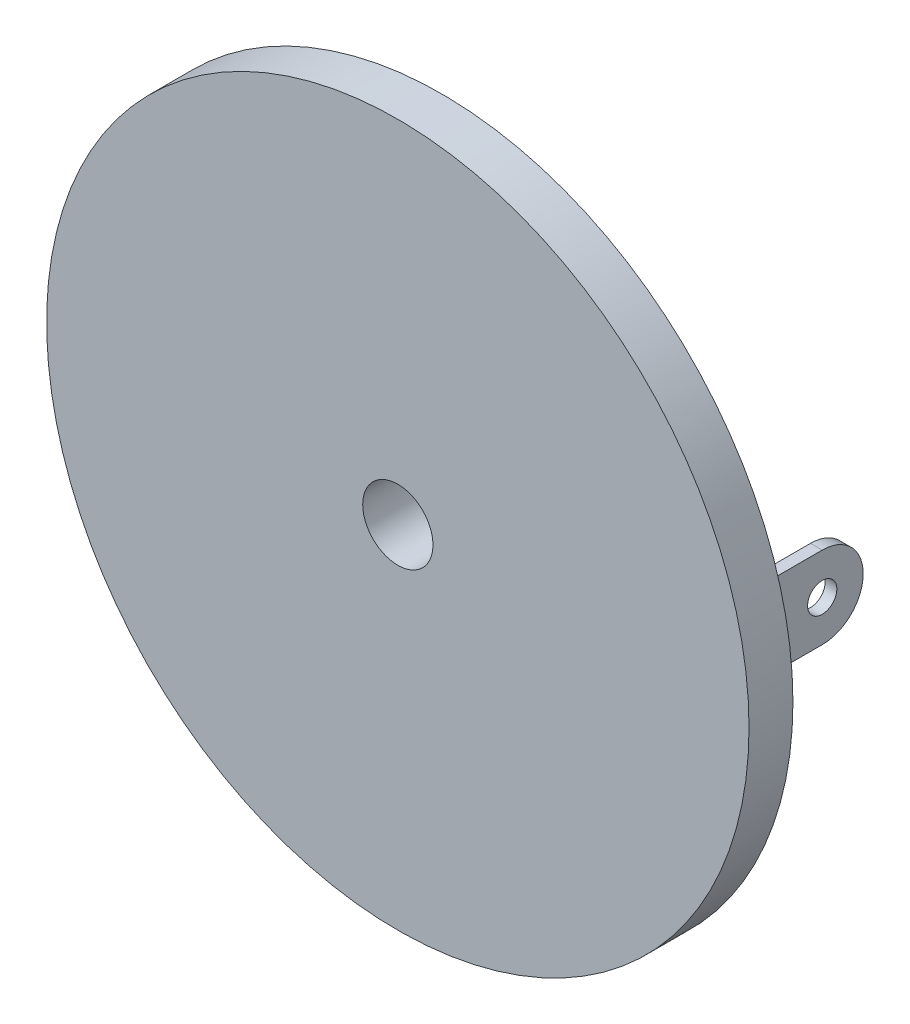
ISO-10303-21;
HEADER;
FILE_DESCRIPTION(('STEP AP214'),'2;1');
FILE_NAME('part.step','',(''),(''),'','','');
FILE_SCHEMA(('AUTOMOTIVE_DESIGN { 1 0 10303 214 1 1 1 1 }'));
ENDSEC;
DATA;
#1=APPLICATION_CONTEXT('core data for automotive mechanical design processes');
#2=APPLICATION_PROTOCOL_DEFINITION('international standard','automotive_design',2000,#1);
#3=PRODUCT_CONTEXT('',#1,'mechanical');
#4=PRODUCT('Part','Part','',(#3));
#5=PRODUCT_RELATED_PRODUCT_CATEGORY('part','',(#4));
#6=PRODUCT_DEFINITION_FORMATION('','',#4);
#7=PRODUCT_DEFINITION_CONTEXT('part definition',#1,'design');
#8=PRODUCT_DEFINITION('design','',#6,#7);
#9=PRODUCT_DEFINITION_SHAPE('','',#8);
#10=(LENGTH_UNIT() NAMED_UNIT(*) SI_UNIT(.MILLI.,.METRE.));
#11=(NAMED_UNIT(*) PLANE_ANGLE_UNIT() SI_UNIT($,.RADIAN.));
#12=(NAMED_UNIT(*) SI_UNIT($,.STERADIAN.) SOLID_ANGLE_UNIT());
#13=UNCERTAINTY_MEASURE_WITH_UNIT(LENGTH_MEASURE(1.E-05),#10,'distance_accuracy_value','');
#14=(GEOMETRIC_REPRESENTATION_CONTEXT(3) GLOBAL_UNCERTAINTY_ASSIGNED_CONTEXT((#13)) GLOBAL_UNIT_ASSIGNED_CONTEXT((#10,
#11,#12)) REPRESENTATION_CONTEXT('',''));
#15=CARTESIAN_POINT('',(0.,0.,0.));
#16=DIRECTION('',(0.,0.,1.));
#17=DIRECTION('',(1.,0.,0.));
#18=AXIS2_PLACEMENT_3D('',#15,#16,#17);
#19=CARTESIAN_POINT('',(0.,0.,0.));
#20=DIRECTION('',(0.,0.,1.));
#21=DIRECTION('',(1.,0.,0.));
#22=AXIS2_PLACEMENT_3D('',#19,#20,#21);
#23=PLANE('',#22);
#24=DIRECTION('',(0.,1.,0.));
#25=VECTOR('',#24,1.);
#26=CARTESIAN_POINT('',(-9.4,1.4,0.));
#27=LINE('',#26,#25);
#28=CARTESIAN_POINT('',(-9.4,-1.4,0.));
#29=VERTEX_POINT('',#28);
#30=CARTESIAN_POINT('',(-9.4,1.4,0.));
#31=VERTEX_POINT('',#30);
#32=EDGE_CURVE('E220',#29,#31,#27,.T.);
#33=ORIENTED_EDGE('',*,*,#32,.F.);
#34=DIRECTION('',(-1.,0.,0.));
#35=VECTOR('',#34,1.);
#36=CARTESIAN_POINT('',(-9.4,-1.4,0.));
#37=LINE('',#36,#35);
#38=CARTESIAN_POINT('',(-9.,-1.4,0.));
#39=VERTEX_POINT('',#38);
#40=EDGE_CURVE('E229',#39,#29,#37,.T.);
#41=ORIENTED_EDGE('',*,*,#40,.F.);
#42=DIRECTION('',(0.,-1.,0.));
#43=VECTOR('',#42,1.);
#44=CARTESIAN_POINT('',(-9.,1.4,0.));
#45=LINE('',#44,#43);
#46=CARTESIAN_POINT('',(-9.,1.4,0.));
#47=VERTEX_POINT('',#46);
#48=EDGE_CURVE('E226',#47,#39,#45,.T.);
#49=ORIENTED_EDGE('',*,*,#48,.F.);
#50=DIRECTION('',(1.,0.,0.));
#51=VECTOR('',#50,1.);
#52=CARTESIAN_POINT('',(-9.4,1.4,0.));
#53=LINE('',#52,#51);
#54=EDGE_CURVE('E223',#31,#47,#53,.T.);
#55=ORIENTED_EDGE('',*,*,#54,.F.);
#56=EDGE_LOOP('',(#33,#41,#49,#55));
#57=FACE_BOUND('',#56,.T.);
#58=CARTESIAN_POINT('',(0.,0.,0.));
#59=DIRECTION('',(0.,0.,1.));
#60=DIRECTION('',(1.,0.,0.));
#61=AXIS2_PLACEMENT_3D('',#58,#59,#60);
#62=CIRCLE('',#61,12.);
#63=CARTESIAN_POINT('',(12.,0.,0.));
#64=VERTEX_POINT('',#63);
#65=EDGE_CURVE('E121',#64,#64,#62,.T.);
#66=ORIENTED_EDGE('',*,*,#65,.F.);
#67=EDGE_LOOP('',(#66));
#68=FACE_BOUND('',#67,.T.);
#69=DIRECTION('',(0.,-1.,0.));
#70=VECTOR('',#69,1.);
#71=CARTESIAN_POINT('',(9.4,1.4,0.));
#72=LINE('',#71,#70);
#73=CARTESIAN_POINT('',(9.4,1.4,0.));
#74=VERTEX_POINT('',#73);
#75=CARTESIAN_POINT('',(9.4,-1.4,0.));
#76=VERTEX_POINT('',#75);
#77=EDGE_CURVE('E120',#74,#76,#72,.T.);
#78=ORIENTED_EDGE('',*,*,#77,.F.);
#79=DIRECTION('',(1.,0.,0.));
#80=VECTOR('',#79,1.);
#81=CARTESIAN_POINT('',(9.4,1.4,0.));
#82=LINE('',#81,#80);
#83=CARTESIAN_POINT('',(9.,1.4,0.));
#84=VERTEX_POINT('',#83);
#85=EDGE_CURVE('E246',#84,#74,#82,.T.);
#86=ORIENTED_EDGE('',*,*,#85,.F.);
#87=DIRECTION('',(0.,1.,0.));
#88=VECTOR('',#87,1.);
#89=CARTESIAN_POINT('',(9.,1.4,0.));
#90=LINE('',#89,#88);
#91=CARTESIAN_POINT('',(9.,-1.4,0.));
#92=VERTEX_POINT('',#91);
#93=EDGE_CURVE('E243',#92,#84,#90,.T.);
#94=ORIENTED_EDGE('',*,*,#93,.F.);
#95=DIRECTION('',(-1.,0.,0.));
#96=VECTOR('',#95,1.);
#97=CARTESIAN_POINT('',(9.4,-1.4,0.));
#98=LINE('',#97,#96);
#99=EDGE_CURVE('E241',#76,#92,#98,.T.);
#100=ORIENTED_EDGE('',*,*,#99,.F.);
#101=EDGE_LOOP('',(#78,#86,#94,#100));
#102=FACE_BOUND('',#101,.T.);
#103=CARTESIAN_POINT('',(0.,0.,0.));
#104=DIRECTION('',(0.,0.,1.));
#105=DIRECTION('',(1.,0.,0.));
#106=AXIS2_PLACEMENT_3D('',#103,#104,#105);
#107=CIRCLE('',#106,4.2);
#108=CARTESIAN_POINT('',(4.2,0.,0.));
#109=VERTEX_POINT('',#108);
#110=EDGE_CURVE('E11',#109,#109,#107,.F.);
#111=ORIENTED_EDGE('',*,*,#110,.F.);
#112=EDGE_LOOP('',(#111));
#113=FACE_BOUND('',#112,.T.);
#114=ADVANCED_FACE('F34',(#57,#68,#102,#113),#23,.F.);
#115=CARTESIAN_POINT('',(0.,0.,1.5));
#116=DIRECTION('',(0.,0.,-1.));
#117=DIRECTION('',(-1.,0.,0.));
#118=AXIS2_PLACEMENT_3D('',#115,#116,#117);
#119=CYLINDRICAL_SURFACE('',#118,12.);
#120=CARTESIAN_POINT('',(0.,0.,1.5));
#121=DIRECTION('',(0.,0.,1.));
#122=DIRECTION('',(1.,0.,0.));
#123=AXIS2_PLACEMENT_3D('',#120,#121,#122);
#124=CIRCLE('',#123,12.);
#125=CARTESIAN_POINT('',(12.,0.,1.5));
#126=VERTEX_POINT('',#125);
#127=EDGE_CURVE('E43',#126,#126,#124,.T.);
#128=ORIENTED_EDGE('',*,*,#127,.F.);
#129=EDGE_LOOP('',(#128));
#130=FACE_BOUND('',#129,.T.);
#131=ORIENTED_EDGE('',*,*,#65,.T.);
#132=EDGE_LOOP('',(#131));
#133=FACE_BOUND('',#132,.T.);
#134=ADVANCED_FACE('F36',(#130,#133),#119,.T.);
#135=CARTESIAN_POINT('',(0.,0.,1.5));
#136=DIRECTION('',(0.,0.,1.));
#137=DIRECTION('',(1.,0.,0.));
#138=AXIS2_PLACEMENT_3D('',#135,#136,#137);
#139=PLANE('',#138);
#140=CARTESIAN_POINT('',(0.,0.,1.5));
#141=DIRECTION('',(0.,0.,-1.));
#142=DIRECTION('',(-1.,0.,0.));
#143=AXIS2_PLACEMENT_3D('',#140,#141,#142);
#144=CIRCLE('',#143,1.2);
#145=CARTESIAN_POINT('',(-1.2,0.,1.5));
#146=VERTEX_POINT('',#145);
#147=EDGE_CURVE('E106',#146,#146,#144,.T.);
#148=ORIENTED_EDGE('',*,*,#147,.T.);
#149=EDGE_LOOP('',(#148));
#150=FACE_BOUND('',#149,.T.);
#151=ORIENTED_EDGE('',*,*,#127,.T.);
#152=EDGE_LOOP('',(#151));
#153=FACE_BOUND('',#152,.T.);
#154=ADVANCED_FACE('F132',(#150,#153),#139,.T.);
#155=CARTESIAN_POINT('',(9.4,1.4,-5.));
#156=DIRECTION('',(-1.,0.,0.));
#157=DIRECTION('',(0.,0.,1.));
#158=AXIS2_PLACEMENT_3D('',#155,#156,#157);
#159=PLANE('',#158);
#160=CARTESIAN_POINT('',(9.4,0.,-3.6));
#161=DIRECTION('',(1.,0.,0.));
#162=DIRECTION('',(0.,0.,-1.));
#163=AXIS2_PLACEMENT_3D('',#160,#161,#162);
#164=CIRCLE('',#163,0.500000000000001);
#165=CARTESIAN_POINT('',(9.4,0.,-4.1));
#166=VERTEX_POINT('',#165);
#167=EDGE_CURVE('E208',#166,#166,#164,.T.);
#168=ORIENTED_EDGE('',*,*,#167,.F.);
#169=EDGE_LOOP('',(#168));
#170=FACE_BOUND('',#169,.T.);
#171=DIRECTION('',(0.,0.,1.));
#172=VECTOR('',#171,1.);
#173=CARTESIAN_POINT('',(9.4,-1.4,-5.));
#174=LINE('',#173,#172);
#175=CARTESIAN_POINT('',(9.4,-1.4,-3.6));
#176=VERTEX_POINT('',#175);
#177=EDGE_CURVE('E112',#176,#76,#174,.T.);
#178=ORIENTED_EDGE('',*,*,#177,.F.);
#179=CARTESIAN_POINT('',(9.4,0.,-3.6));
#180=DIRECTION('',(-1.,0.,0.));
#181=DIRECTION('',(0.,0.,-1.));
#182=AXIS2_PLACEMENT_3D('',#179,#180,#181);
#183=CIRCLE('',#182,1.4);
#184=CARTESIAN_POINT('',(9.4,1.4,-3.6));
#185=VERTEX_POINT('',#184);
#186=EDGE_CURVE('E98',#185,#176,#183,.T.);
#187=ORIENTED_EDGE('',*,*,#186,.F.);
#188=DIRECTION('',(0.,0.,1.));
#189=VECTOR('',#188,1.);
#190=CARTESIAN_POINT('',(9.4,1.4,-5.));
#191=LINE('',#190,#189);
#192=EDGE_CURVE('E248',#185,#74,#191,.T.);
#193=ORIENTED_EDGE('',*,*,#192,.T.);
#194=ORIENTED_EDGE('',*,*,#77,.T.);
#195=EDGE_LOOP('',(#178,#187,#193,#194));
#196=FACE_BOUND('',#195,.T.);
#197=ADVANCED_FACE('F118',(#170,#196),#159,.F.);
#198=CARTESIAN_POINT('',(9.4,-1.4,-5.));
#199=DIRECTION('',(0.,1.,0.));
#200=DIRECTION('',(0.,0.,1.));
#201=AXIS2_PLACEMENT_3D('',#198,#199,#200);
#202=PLANE('',#201);
#203=DIRECTION('',(0.,0.,1.));
#204=VECTOR('',#203,1.);
#205=CARTESIAN_POINT('',(9.,-1.4,-5.));
#206=LINE('',#205,#204);
#207=CARTESIAN_POINT('',(9.,-1.4,-3.6));
#208=VERTEX_POINT('',#207);
#209=EDGE_CURVE('E114',#208,#92,#206,.T.);
#210=ORIENTED_EDGE('',*,*,#209,.F.);
#211=DIRECTION('',(1.,0.,0.));
#212=VECTOR('',#211,1.);
#213=CARTESIAN_POINT('',(-12.,-1.4,-3.6));
#214=LINE('',#213,#212);
#215=EDGE_CURVE('E101',#208,#176,#214,.T.);
#216=ORIENTED_EDGE('',*,*,#215,.T.);
#217=ORIENTED_EDGE('',*,*,#177,.T.);
#218=ORIENTED_EDGE('',*,*,#99,.T.);
#219=EDGE_LOOP('',(#210,#216,#217,#218));
#220=FACE_BOUND('',#219,.T.);
#221=ADVANCED_FACE('F110',(#220),#202,.F.);
#222=CARTESIAN_POINT('',(9.,1.4,-5.));
#223=DIRECTION('',(1.,0.,0.));
#224=DIRECTION('',(0.,0.,-1.));
#225=AXIS2_PLACEMENT_3D('',#222,#223,#224);
#226=PLANE('',#225);
#227=CARTESIAN_POINT('',(9.,0.,-3.6));
#228=DIRECTION('',(1.,0.,0.));
#229=DIRECTION('',(0.,0.,-1.));
#230=AXIS2_PLACEMENT_3D('',#227,#228,#229);
#231=CIRCLE('',#230,0.500000000000001);
#232=CARTESIAN_POINT('',(9.,0.,-4.1));
#233=VERTEX_POINT('',#232);
#234=EDGE_CURVE('E214',#233,#233,#231,.T.);
#235=ORIENTED_EDGE('',*,*,#234,.T.);
#236=EDGE_LOOP('',(#235));
#237=FACE_BOUND('',#236,.T.);
#238=DIRECTION('',(0.,0.,1.));
#239=VECTOR('',#238,1.);
#240=CARTESIAN_POINT('',(9.,1.4,-5.));
#241=LINE('',#240,#239);
#242=CARTESIAN_POINT('',(9.,1.4,-3.6));
#243=VERTEX_POINT('',#242);
#244=EDGE_CURVE('E125',#243,#84,#241,.T.);
#245=ORIENTED_EDGE('',*,*,#244,.F.);
#246=CARTESIAN_POINT('',(9.,0.,-3.6));
#247=DIRECTION('',(1.,0.,0.));
#248=DIRECTION('',(0.,0.,-1.));
#249=AXIS2_PLACEMENT_3D('',#246,#247,#248);
#250=CIRCLE('',#249,1.4);
#251=EDGE_CURVE('E50',#243,#208,#250,.F.);
#252=ORIENTED_EDGE('',*,*,#251,.T.);
#253=ORIENTED_EDGE('',*,*,#209,.T.);
#254=ORIENTED_EDGE('',*,*,#93,.T.);
#255=EDGE_LOOP('',(#245,#252,#253,#254));
#256=FACE_BOUND('',#255,.T.);
#257=ADVANCED_FACE('F180',(#237,#256),#226,.F.);
#258=CARTESIAN_POINT('',(9.4,1.4,-5.));
#259=DIRECTION('',(0.,-1.,0.));
#260=DIRECTION('',(0.,0.,-1.));
#261=AXIS2_PLACEMENT_3D('',#258,#259,#260);
#262=PLANE('',#261);
#263=ORIENTED_EDGE('',*,*,#192,.F.);
#264=DIRECTION('',(1.,0.,0.));
#265=VECTOR('',#264,1.);
#266=CARTESIAN_POINT('',(-12.,1.4,-3.6));
#267=LINE('',#266,#265);
#268=EDGE_CURVE('E102',#243,#185,#267,.T.);
#269=ORIENTED_EDGE('',*,*,#268,.F.);
#270=ORIENTED_EDGE('',*,*,#244,.T.);
#271=ORIENTED_EDGE('',*,*,#85,.T.);
#272=EDGE_LOOP('',(#263,#269,#270,#271));
#273=FACE_BOUND('',#272,.T.);
#274=ADVANCED_FACE('F176',(#273),#262,.F.);
#275=CARTESIAN_POINT('',(-9.4,1.4,-5.));
#276=DIRECTION('',(1.,0.,0.));
#277=DIRECTION('',(0.,0.,-1.));
#278=AXIS2_PLACEMENT_3D('',#275,#276,#277);
#279=PLANE('',#278);
#280=CARTESIAN_POINT('',(-9.4,0.,-3.6));
#281=DIRECTION('',(1.,0.,0.));
#282=DIRECTION('',(0.,0.,-1.));
#283=AXIS2_PLACEMENT_3D('',#280,#281,#282);
#284=CIRCLE('',#283,0.500000000000001);
#285=CARTESIAN_POINT('',(-9.4,0.,-4.1));
#286=VERTEX_POINT('',#285);
#287=EDGE_CURVE('E211',#286,#286,#284,.T.);
#288=ORIENTED_EDGE('',*,*,#287,.T.);
#289=EDGE_LOOP('',(#288));
#290=FACE_BOUND('',#289,.T.);
#291=DIRECTION('',(0.,0.,1.));
#292=VECTOR('',#291,1.);
#293=CARTESIAN_POINT('',(-9.4,1.4,-5.));
#294=LINE('',#293,#292);
#295=CARTESIAN_POINT('',(-9.4,1.4,-3.6));
#296=VERTEX_POINT('',#295);
#297=EDGE_CURVE('E238',#296,#31,#294,.T.);
#298=ORIENTED_EDGE('',*,*,#297,.F.);
#299=CARTESIAN_POINT('',(-9.4,0.,-3.6));
#300=DIRECTION('',(1.,0.,0.));
#301=DIRECTION('',(0.,0.,-1.));
#302=AXIS2_PLACEMENT_3D('',#299,#300,#301);
#303=CIRCLE('',#302,1.4);
#304=CARTESIAN_POINT('',(-9.4,-1.4,-3.6));
#305=VERTEX_POINT('',#304);
#306=EDGE_CURVE('E204',#296,#305,#303,.F.);
#307=ORIENTED_EDGE('',*,*,#306,.T.);
#308=DIRECTION('',(0.,0.,1.));
#309=VECTOR('',#308,1.);
#310=CARTESIAN_POINT('',(-9.4,-1.4,-5.));
#311=LINE('',#310,#309);
#312=EDGE_CURVE('E232',#305,#29,#311,.T.);
#313=ORIENTED_EDGE('',*,*,#312,.T.);
#314=ORIENTED_EDGE('',*,*,#32,.T.);
#315=EDGE_LOOP('',(#298,#307,#313,#314));
#316=FACE_BOUND('',#315,.T.);
#317=ADVANCED_FACE('F172',(#290,#316),#279,.F.);
#318=CARTESIAN_POINT('',(-9.4,1.4,-5.));
#319=DIRECTION('',(0.,-1.,0.));
#320=DIRECTION('',(0.,0.,-1.));
#321=AXIS2_PLACEMENT_3D('',#318,#319,#320);
#322=PLANE('',#321);
#323=DIRECTION('',(0.,0.,1.));
#324=VECTOR('',#323,1.);
#325=CARTESIAN_POINT('',(-9.,1.4,-5.));
#326=LINE('',#325,#324);
#327=CARTESIAN_POINT('',(-9.,1.4,-3.6));
#328=VERTEX_POINT('',#327);
#329=EDGE_CURVE('E236',#328,#47,#326,.T.);
#330=ORIENTED_EDGE('',*,*,#329,.F.);
#331=EDGE_CURVE('E201',#296,#328,#267,.T.);
#332=ORIENTED_EDGE('',*,*,#331,.F.);
#333=ORIENTED_EDGE('',*,*,#297,.T.);
#334=ORIENTED_EDGE('',*,*,#54,.T.);
#335=EDGE_LOOP('',(#330,#332,#333,#334));
#336=FACE_BOUND('',#335,.T.);
#337=ADVANCED_FACE('F168',(#336),#322,.F.);
#338=CARTESIAN_POINT('',(-9.,1.4,-5.));
#339=DIRECTION('',(-1.,0.,0.));
#340=DIRECTION('',(0.,0.,1.));
#341=AXIS2_PLACEMENT_3D('',#338,#339,#340);
#342=PLANE('',#341);
#343=CARTESIAN_POINT('',(-9.,0.,-3.6));
#344=DIRECTION('',(-1.,0.,0.));
#345=DIRECTION('',(0.,0.,1.));
#346=AXIS2_PLACEMENT_3D('',#343,#344,#345);
#347=CIRCLE('',#346,0.500000000000001);
#348=CARTESIAN_POINT('',(-9.,0.,-3.1));
#349=VERTEX_POINT('',#348);
#350=EDGE_CURVE('E38',#349,#349,#347,.T.);
#351=ORIENTED_EDGE('',*,*,#350,.T.);
#352=EDGE_LOOP('',(#351));
#353=FACE_BOUND('',#352,.T.);
#354=DIRECTION('',(0.,0.,1.));
#355=VECTOR('',#354,1.);
#356=CARTESIAN_POINT('',(-9.,-1.4,-5.));
#357=LINE('',#356,#355);
#358=CARTESIAN_POINT('',(-9.,-1.4,-3.6));
#359=VERTEX_POINT('',#358);
#360=EDGE_CURVE('E234',#359,#39,#357,.T.);
#361=ORIENTED_EDGE('',*,*,#360,.F.);
#362=CARTESIAN_POINT('',(-9.,0.,-3.6));
#363=DIRECTION('',(-1.,0.,0.));
#364=DIRECTION('',(0.,0.,1.));
#365=AXIS2_PLACEMENT_3D('',#362,#363,#364);
#366=CIRCLE('',#365,1.4);
#367=EDGE_CURVE('E58',#359,#328,#366,.F.);
#368=ORIENTED_EDGE('',*,*,#367,.T.);
#369=ORIENTED_EDGE('',*,*,#329,.T.);
#370=ORIENTED_EDGE('',*,*,#48,.T.);
#371=EDGE_LOOP('',(#361,#368,#369,#370));
#372=FACE_BOUND('',#371,.T.);
#373=ADVANCED_FACE('F160',(#353,#372),#342,.F.);
#374=CARTESIAN_POINT('',(-9.4,-1.4,-5.));
#375=DIRECTION('',(0.,1.,0.));
#376=DIRECTION('',(0.,0.,1.));
#377=AXIS2_PLACEMENT_3D('',#374,#375,#376);
#378=PLANE('',#377);
#379=ORIENTED_EDGE('',*,*,#312,.F.);
#380=EDGE_CURVE('E115',#305,#359,#214,.T.);
#381=ORIENTED_EDGE('',*,*,#380,.T.);
#382=ORIENTED_EDGE('',*,*,#360,.T.);
#383=ORIENTED_EDGE('',*,*,#40,.T.);
#384=EDGE_LOOP('',(#379,#381,#382,#383));
#385=FACE_BOUND('',#384,.T.);
#386=ADVANCED_FACE('F150',(#385),#378,.F.);
#387=CARTESIAN_POINT('',(0.,0.,-2.));
#388=DIRECTION('',(0.,0.,1.));
#389=DIRECTION('',(1.,0.,0.));
#390=AXIS2_PLACEMENT_3D('',#387,#388,#389);
#391=CYLINDRICAL_SURFACE('',#390,4.2);
#392=CARTESIAN_POINT('',(0.,0.,-2.));
#393=DIRECTION('',(0.,0.,-1.));
#394=DIRECTION('',(-1.,0.,0.));
#395=AXIS2_PLACEMENT_3D('',#392,#393,#394);
#396=CIRCLE('',#395,4.2);
#397=CARTESIAN_POINT('',(-4.2,0.,-2.));
#398=VERTEX_POINT('',#397);
#399=EDGE_CURVE('E217',#398,#398,#396,.T.);
#400=ORIENTED_EDGE('',*,*,#399,.F.);
#401=EDGE_LOOP('',(#400));
#402=FACE_BOUND('',#401,.T.);
#403=ORIENTED_EDGE('',*,*,#110,.T.);
#404=EDGE_LOOP('',(#403));
#405=FACE_BOUND('',#404,.T.);
#406=ADVANCED_FACE('F147',(#402,#405),#391,.T.);
#407=CARTESIAN_POINT('',(0.,0.,-2.));
#408=DIRECTION('',(0.,0.,-1.));
#409=DIRECTION('',(-1.,0.,0.));
#410=AXIS2_PLACEMENT_3D('',#407,#408,#409);
#411=PLANE('',#410);
#412=CARTESIAN_POINT('',(0.,0.,-2.));
#413=DIRECTION('',(0.,0.,-1.));
#414=DIRECTION('',(-1.,0.,0.));
#415=AXIS2_PLACEMENT_3D('',#412,#413,#414);
#416=CIRCLE('',#415,1.2);
#417=CARTESIAN_POINT('',(-1.2,0.,-2.));
#418=VERTEX_POINT('',#417);
#419=EDGE_CURVE('E196',#418,#418,#416,.T.);
#420=ORIENTED_EDGE('',*,*,#419,.F.);
#421=EDGE_LOOP('',(#420));
#422=FACE_BOUND('',#421,.T.);
#423=ORIENTED_EDGE('',*,*,#399,.T.);
#424=EDGE_LOOP('',(#423));
#425=FACE_BOUND('',#424,.T.);
#426=ADVANCED_FACE('F149',(#422,#425),#411,.T.);
#427=CARTESIAN_POINT('',(-12.,0.,-3.6));
#428=DIRECTION('',(1.,0.,0.));
#429=DIRECTION('',(0.,0.,-1.));
#430=AXIS2_PLACEMENT_3D('',#427,#428,#429);
#431=CYLINDRICAL_SURFACE('',#430,0.500000000000001);
#432=ORIENTED_EDGE('',*,*,#350,.F.);
#433=EDGE_LOOP('',(#432));
#434=FACE_BOUND('',#433,.T.);
#435=ORIENTED_EDGE('',*,*,#287,.F.);
#436=EDGE_LOOP('',(#435));
#437=FACE_BOUND('',#436,.T.);
#438=ADVANCED_FACE('F157',(#434,#437),#431,.F.);
#439=ORIENTED_EDGE('',*,*,#167,.T.);
#440=EDGE_LOOP('',(#439));
#441=FACE_BOUND('',#440,.T.);
#442=ORIENTED_EDGE('',*,*,#234,.F.);
#443=EDGE_LOOP('',(#442));
#444=FACE_BOUND('',#443,.T.);
#445=ADVANCED_FACE('F265',(#441,#444),#431,.F.);
#446=CARTESIAN_POINT('',(-12.,0.,-3.6));
#447=DIRECTION('',(1.,0.,0.));
#448=DIRECTION('',(0.,0.,-1.));
#449=AXIS2_PLACEMENT_3D('',#446,#447,#448);
#450=CYLINDRICAL_SURFACE('',#449,1.4);
#451=ORIENTED_EDGE('',*,*,#306,.F.);
#452=ORIENTED_EDGE('',*,*,#331,.T.);
#453=ORIENTED_EDGE('',*,*,#367,.F.);
#454=ORIENTED_EDGE('',*,*,#380,.F.);
#455=EDGE_LOOP('',(#451,#452,#453,#454));
#456=FACE_BOUND('',#455,.T.);
#457=ADVANCED_FACE('F263',(#456),#450,.T.);
#458=ORIENTED_EDGE('',*,*,#251,.F.);
#459=ORIENTED_EDGE('',*,*,#268,.T.);
#460=ORIENTED_EDGE('',*,*,#186,.T.);
#461=ORIENTED_EDGE('',*,*,#215,.F.);
#462=EDGE_LOOP('',(#458,#459,#460,#461));
#463=FACE_BOUND('',#462,.T.);
#464=ADVANCED_FACE('F100',(#463),#450,.T.);
#465=CARTESIAN_POINT('',(0.,0.,1.5));
#466=DIRECTION('',(0.,0.,-1.));
#467=DIRECTION('',(-1.,0.,0.));
#468=AXIS2_PLACEMENT_3D('',#465,#466,#467);
#469=CYLINDRICAL_SURFACE('',#468,1.2);
#470=ORIENTED_EDGE('',*,*,#147,.F.);
#471=EDGE_LOOP('',(#470));
#472=FACE_BOUND('',#471,.T.);
#473=ORIENTED_EDGE('',*,*,#419,.T.);
#474=EDGE_LOOP('',(#473));
#475=FACE_BOUND('',#474,.T.);
#476=ADVANCED_FACE('F271',(#472,#475),#469,.F.);
#477=CLOSED_SHELL('',(#114,#134,#154,#197,#221,#257,#274,#317,#337,#373,#386,#406,#426,#438,
#445,#457,#464,#476));
#478=MANIFOLD_SOLID_BREP('B2',#477);
#479=ADVANCED_BREP_SHAPE_REPRESENTATION('',(#18,#478),#14);
#480=SHAPE_DEFINITION_REPRESENTATION(#9,#479);
ENDSEC;
END-ISO-10303-21;
